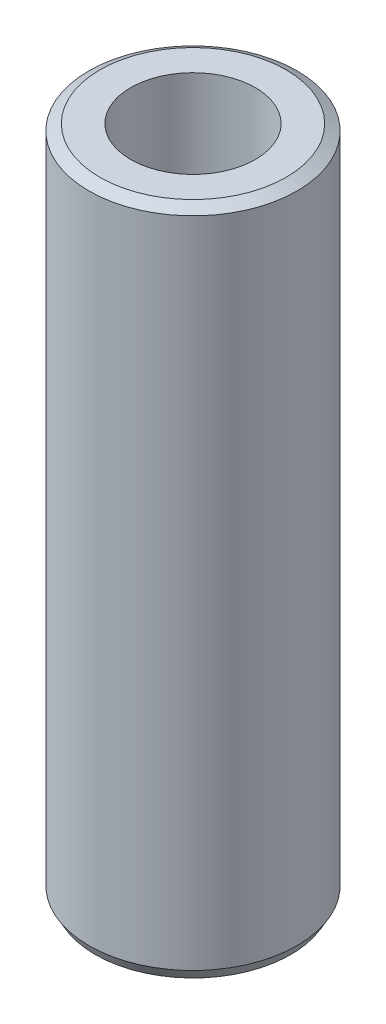
ISO-10303-21;
HEADER;
FILE_DESCRIPTION(('STEP AP214'),'2;1');
FILE_NAME('part.step','',(''),(''),'','','');
FILE_SCHEMA(('AUTOMOTIVE_DESIGN { 1 0 10303 214 1 1 1 1 }'));
ENDSEC;
DATA;
#1=APPLICATION_CONTEXT('core data for automotive mechanical design processes');
#2=APPLICATION_PROTOCOL_DEFINITION('international standard','automotive_design',2000,#1);
#3=PRODUCT_CONTEXT('',#1,'mechanical');
#4=PRODUCT('Part','Part','',(#3));
#5=PRODUCT_RELATED_PRODUCT_CATEGORY('part','',(#4));
#6=PRODUCT_DEFINITION_FORMATION('','',#4);
#7=PRODUCT_DEFINITION_CONTEXT('part definition',#1,'design');
#8=PRODUCT_DEFINITION('design','',#6,#7);
#9=PRODUCT_DEFINITION_SHAPE('','',#8);
#10=(LENGTH_UNIT() NAMED_UNIT(*) SI_UNIT(.MILLI.,.METRE.));
#11=(NAMED_UNIT(*) PLANE_ANGLE_UNIT() SI_UNIT($,.RADIAN.));
#12=(NAMED_UNIT(*) SI_UNIT($,.STERADIAN.) SOLID_ANGLE_UNIT());
#13=UNCERTAINTY_MEASURE_WITH_UNIT(LENGTH_MEASURE(1.E-05),#10,'distance_accuracy_value','');
#14=(GEOMETRIC_REPRESENTATION_CONTEXT(3) GLOBAL_UNCERTAINTY_ASSIGNED_CONTEXT((#13)) GLOBAL_UNIT_ASSIGNED_CONTEXT((#10,
#11,#12)) REPRESENTATION_CONTEXT('',''));
#15=CARTESIAN_POINT('',(0.,0.,0.));
#16=DIRECTION('',(0.,0.,1.));
#17=DIRECTION('',(1.,0.,0.));
#18=AXIS2_PLACEMENT_3D('',#15,#16,#17);
#19=CARTESIAN_POINT('',(0.,48.3409583217913,0.));
#20=DIRECTION('',(0.,-1.,0.));
#21=DIRECTION('',(0.,0.,-1.));
#22=AXIS2_PLACEMENT_3D('',#19,#20,#21);
#23=CYLINDRICAL_SURFACE('',#22,7.5);
#24=CARTESIAN_POINT('',(0.,47.8849871190354,0.));
#25=DIRECTION('',(0.,1.,0.));
#26=DIRECTION('',(0.,0.,1.));
#27=AXIS2_PLACEMENT_3D('',#24,#25,#26);
#28=CIRCLE('',#27,7.5);
#29=CARTESIAN_POINT('',(0.,47.8849871190354,7.5));
#30=VERTEX_POINT('',#29);
#31=EDGE_CURVE('E50',#30,#30,#28,.F.);
#32=ORIENTED_EDGE('',*,*,#31,.T.);
#33=EDGE_LOOP('',(#32));
#34=FACE_BOUND('',#33,.T.);
#35=CARTESIAN_POINT('',(0.,0.789765289961553,0.));
#36=DIRECTION('',(0.,1.,0.));
#37=DIRECTION('',(0.,0.,1.));
#38=AXIS2_PLACEMENT_3D('',#35,#36,#37);
#39=CIRCLE('',#38,7.5);
#40=CARTESIAN_POINT('',(0.,0.789765289961553,7.5));
#41=VERTEX_POINT('',#40);
#42=EDGE_CURVE('E51',#41,#41,#39,.T.);
#43=ORIENTED_EDGE('',*,*,#42,.T.);
#44=EDGE_LOOP('',(#43));
#45=FACE_BOUND('',#44,.T.);
#46=ADVANCED_FACE('F39',(#34,#45),#23,.T.);
#47=CARTESIAN_POINT('',(0.,48.3409583217913,0.));
#48=DIRECTION('',(0.,1.,0.));
#49=DIRECTION('',(0.,0.,1.));
#50=AXIS2_PLACEMENT_3D('',#47,#48,#49);
#51=PLANE('',#50);
#52=CARTESIAN_POINT('',(0.,48.3409583217913,0.));
#53=DIRECTION('',(0.,1.,0.));
#54=DIRECTION('',(0.,0.,1.));
#55=AXIS2_PLACEMENT_3D('',#52,#53,#54);
#56=CIRCLE('',#55,6.71023471003845);
#57=CARTESIAN_POINT('',(0.,48.3409583217913,6.71023471003845));
#58=VERTEX_POINT('',#57);
#59=EDGE_CURVE('E54',#58,#58,#56,.T.);
#60=ORIENTED_EDGE('',*,*,#59,.T.);
#61=EDGE_LOOP('',(#60));
#62=FACE_BOUND('',#61,.T.);
#63=CARTESIAN_POINT('',(0.,48.3409583217913,0.));
#64=DIRECTION('',(0.,1.,0.));
#65=DIRECTION('',(0.,0.,1.));
#66=AXIS2_PLACEMENT_3D('',#63,#64,#65);
#67=CIRCLE('',#66,4.4916396019);
#68=CARTESIAN_POINT('',(0.,48.3409583217913,4.4916396019));
#69=VERTEX_POINT('',#68);
#70=EDGE_CURVE('E58',#69,#69,#67,.T.);
#71=ORIENTED_EDGE('',*,*,#70,.F.);
#72=EDGE_LOOP('',(#71));
#73=FACE_BOUND('',#72,.T.);
#74=ADVANCED_FACE('F69',(#62,#73),#51,.T.);
#75=CARTESIAN_POINT('',(0.,0.,0.));
#76=DIRECTION('',(0.,1.,0.));
#77=DIRECTION('',(0.,0.,1.));
#78=AXIS2_PLACEMENT_3D('',#75,#76,#77);
#79=PLANE('',#78);
#80=CARTESIAN_POINT('',(0.,0.,0.));
#81=DIRECTION('',(0.,1.,0.));
#82=DIRECTION('',(0.,0.,1.));
#83=AXIS2_PLACEMENT_3D('',#80,#81,#82);
#84=CIRCLE('',#83,7.04402879724407);
#85=CARTESIAN_POINT('',(0.,0.,7.04402879724407));
#86=VERTEX_POINT('',#85);
#87=EDGE_CURVE('E10',#86,#86,#84,.F.);
#88=ORIENTED_EDGE('',*,*,#87,.T.);
#89=EDGE_LOOP('',(#88));
#90=FACE_BOUND('',#89,.T.);
#91=CARTESIAN_POINT('',(0.,0.,0.));
#92=DIRECTION('',(0.,1.,0.));
#93=DIRECTION('',(0.,0.,1.));
#94=AXIS2_PLACEMENT_3D('',#91,#92,#93);
#95=CIRCLE('',#94,4.4916396019);
#96=CARTESIAN_POINT('',(0.,0.,4.4916396019));
#97=VERTEX_POINT('',#96);
#98=EDGE_CURVE('E63',#97,#97,#95,.T.);
#99=ORIENTED_EDGE('',*,*,#98,.T.);
#100=EDGE_LOOP('',(#99));
#101=FACE_BOUND('',#100,.T.);
#102=ADVANCED_FACE('F75',(#90,#101),#79,.F.);
#103=CARTESIAN_POINT('',(0.,48.3409583217913,0.));
#104=DIRECTION('',(0.,-1.,0.));
#105=DIRECTION('',(0.,0.,-1.));
#106=AXIS2_PLACEMENT_3D('',#103,#104,#105);
#107=CYLINDRICAL_SURFACE('',#106,4.4916396019);
#108=ORIENTED_EDGE('',*,*,#70,.T.);
#109=EDGE_LOOP('',(#108));
#110=FACE_BOUND('',#109,.T.);
#111=ORIENTED_EDGE('',*,*,#98,.F.);
#112=EDGE_LOOP('',(#111));
#113=FACE_BOUND('',#112,.T.);
#114=ADVANCED_FACE('F70',(#110,#113),#107,.F.);
#115=CARTESIAN_POINT('',(0.,48.3409583217913,0.));
#116=DIRECTION('',(0.,-1.,0.));
#117=DIRECTION('',(0.,0.,-1.));
#118=AXIS2_PLACEMENT_3D('',#115,#116,#117);
#119=CONICAL_SURFACE('',#118,6.71023471003845,1.0471975511966);
#120=ORIENTED_EDGE('',*,*,#31,.F.);
#121=EDGE_LOOP('',(#120));
#122=FACE_BOUND('',#121,.T.);
#123=ORIENTED_EDGE('',*,*,#59,.F.);
#124=EDGE_LOOP('',(#123));
#125=FACE_BOUND('',#124,.T.);
#126=ADVANCED_FACE('F81',(#122,#125),#119,.T.);
#127=CARTESIAN_POINT('',(0.,0.789765289961553,0.));
#128=DIRECTION('',(0.,1.,0.));
#129=DIRECTION('',(0.,0.,1.));
#130=AXIS2_PLACEMENT_3D('',#127,#128,#129);
#131=CONICAL_SURFACE('',#130,7.5,0.523598775598306);
#132=ORIENTED_EDGE('',*,*,#87,.F.);
#133=EDGE_LOOP('',(#132));
#134=FACE_BOUND('',#133,.T.);
#135=ORIENTED_EDGE('',*,*,#42,.F.);
#136=EDGE_LOOP('',(#135));
#137=FACE_BOUND('',#136,.T.);
#138=ADVANCED_FACE('F45',(#134,#137),#131,.T.);
#139=CLOSED_SHELL('',(#46,#74,#102,#114,#126,#138));
#140=MANIFOLD_SOLID_BREP('B2',#139);
#141=ADVANCED_BREP_SHAPE_REPRESENTATION('',(#18,#140),#14);
#142=SHAPE_DEFINITION_REPRESENTATION(#9,#141);
ENDSEC;
END-ISO-10303-21;
